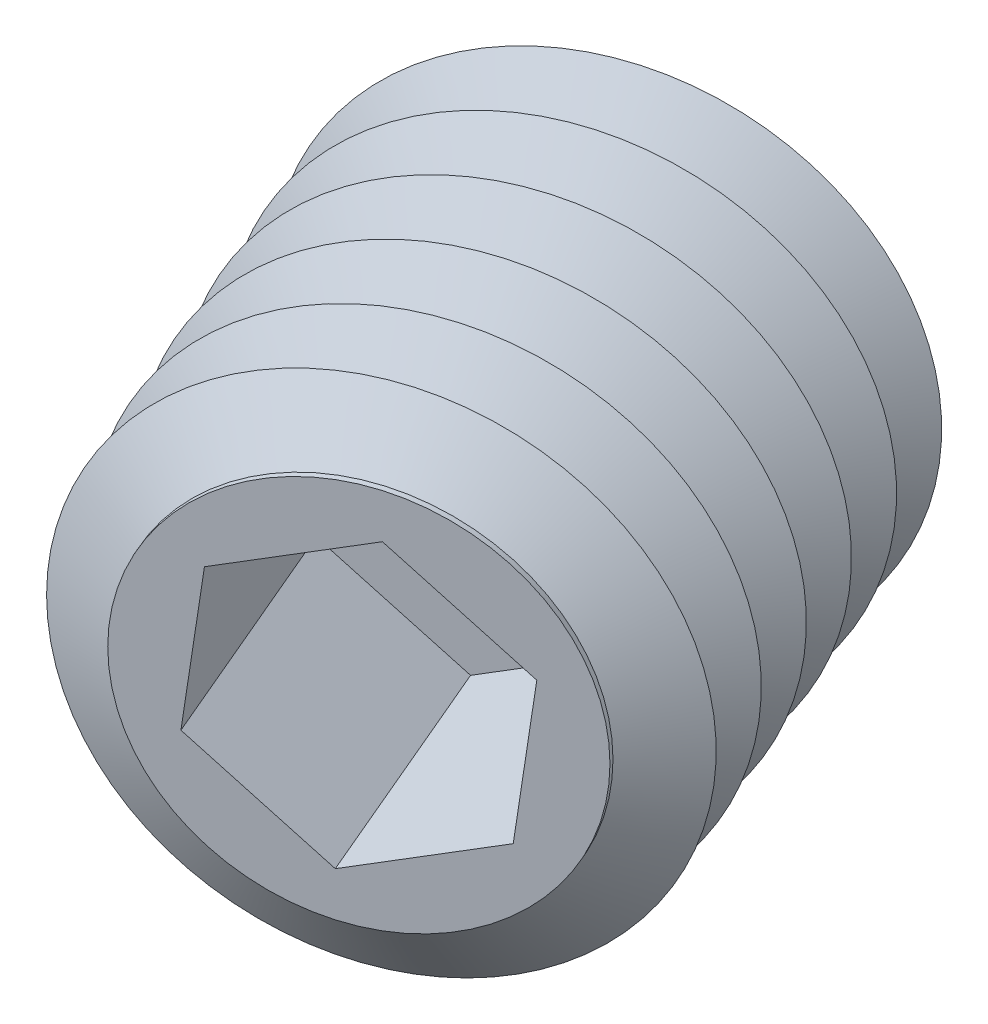
ISO-10303-21;
HEADER;
FILE_DESCRIPTION(('STEP AP214'),'2;1');
FILE_NAME('part.step','',(''),(''),'','','');
FILE_SCHEMA(('AUTOMOTIVE_DESIGN { 1 0 10303 214 1 1 1 1 }'));
ENDSEC;
DATA;
#1=APPLICATION_CONTEXT('core data for automotive mechanical design processes');
#2=APPLICATION_PROTOCOL_DEFINITION('international standard','automotive_design',2000,#1);
#3=PRODUCT_CONTEXT('',#1,'mechanical');
#4=PRODUCT('Part','Part','',(#3));
#5=PRODUCT_RELATED_PRODUCT_CATEGORY('part','',(#4));
#6=PRODUCT_DEFINITION_FORMATION('','',#4);
#7=PRODUCT_DEFINITION_CONTEXT('part definition',#1,'design');
#8=PRODUCT_DEFINITION('design','',#6,#7);
#9=PRODUCT_DEFINITION_SHAPE('','',#8);
#10=(LENGTH_UNIT() NAMED_UNIT(*) SI_UNIT(.MILLI.,.METRE.));
#11=(NAMED_UNIT(*) PLANE_ANGLE_UNIT() SI_UNIT($,.RADIAN.));
#12=(NAMED_UNIT(*) SI_UNIT($,.STERADIAN.) SOLID_ANGLE_UNIT());
#13=UNCERTAINTY_MEASURE_WITH_UNIT(LENGTH_MEASURE(1.E-05),#10,'distance_accuracy_value','');
#14=(GEOMETRIC_REPRESENTATION_CONTEXT(3) GLOBAL_UNCERTAINTY_ASSIGNED_CONTEXT((#13)) GLOBAL_UNIT_ASSIGNED_CONTEXT((#10,
#11,#12)) REPRESENTATION_CONTEXT('',''));
#15=CARTESIAN_POINT('',(0.,0.,0.));
#16=DIRECTION('',(0.,0.,1.));
#17=DIRECTION('',(1.,0.,0.));
#18=AXIS2_PLACEMENT_3D('',#15,#16,#17);
#19=CARTESIAN_POINT('',(53.6140702150309,-7.80000000000007,152.883076301382));
#20=DIRECTION('',(-0.390731128489286,0.,-0.920504853452435));
#21=DIRECTION('',(-0.920504853452435,0.,0.390731128489286));
#22=AXIS2_PLACEMENT_3D('',#19,#20,#21);
#23=CONICAL_SURFACE('',#22,1.99999999996604,0.785398163382625);
#24=CARTESIAN_POINT('',(54.3955324720193,-7.80000000000006,154.72408600831));
#25=VERTEX_POINT('',#24);
#26=VERTEX_LOOP('',#25);
#27=FACE_BOUND('',#26,.T.);
#28=CARTESIAN_POINT('',(53.6140702150309,-7.80000000000007,152.883076301382));
#29=DIRECTION('',(0.390731128489286,0.,0.920504853452435));
#30=DIRECTION('',(0.,-1.,0.));
#31=AXIS2_PLACEMENT_3D('',#28,#29,#30);
#32=CIRCLE('',#31,1.99999999996599);
#33=CARTESIAN_POINT('',(53.6140702150309,-9.79999999996606,152.883076301382));
#34=VERTEX_POINT('',#33);
#35=EDGE_CURVE('E331',#34,#34,#32,.T.);
#36=ORIENTED_EDGE('',*,*,#35,.F.);
#37=EDGE_LOOP('',(#36));
#38=FACE_BOUND('',#37,.T.);
#39=ADVANCED_FACE('F16',(#27,#38),#23,.F.);
#40=CARTESIAN_POINT('',(53.6271572263265,-7.80000000000007,152.913907367904));
#41=DIRECTION('',(0.390731128489274,0.,0.92050485345244));
#42=DIRECTION('',(0.,-1.,0.));
#43=AXIS2_PLACEMENT_3D('',#40,#41,#42);
#44=CYLINDRICAL_SURFACE('',#43,2.25);
#45=CARTESIAN_POINT('',(53.6140702150345,-7.80000000000007,152.883076301391));
#46=DIRECTION('',(-0.390731128489274,0.,-0.92050485345244));
#47=DIRECTION('',(-0.92050485345244,0.,0.390731128489274));
#48=AXIS2_PLACEMENT_3D('',#45,#46,#47);
#49=CIRCLE('',#48,2.25);
#50=CARTESIAN_POINT('',(51.5429342947665,-7.80000000000007,153.762221340491));
#51=VERTEX_POINT('',#50);
#52=EDGE_CURVE('E118',#51,#51,#49,.T.);
#53=ORIENTED_EDGE('',*,*,#52,.F.);
#54=EDGE_LOOP('',(#53));
#55=FACE_BOUND('',#54,.T.);
#56=CARTESIAN_POINT('',(53.6402442376186,-7.80000000000007,152.944738434418));
#57=DIRECTION('',(-0.390731128489274,0.,-0.92050485345244));
#58=DIRECTION('',(-0.92050485345244,0.,0.390731128489274));
#59=AXIS2_PLACEMENT_3D('',#56,#57,#58);
#60=CIRCLE('',#59,2.25);
#61=CARTESIAN_POINT('',(51.5691083173506,-7.80000000000007,153.823883473519));
#62=VERTEX_POINT('',#61);
#63=EDGE_CURVE('E11',#62,#62,#60,.T.);
#64=ORIENTED_EDGE('',*,*,#63,.T.);
#65=EDGE_LOOP('',(#64));
#66=FACE_BOUND('',#65,.T.);
#67=ADVANCED_FACE('F135',(#55,#66),#44,.T.);
#68=CARTESIAN_POINT('',(53.8094357793032,-7.80000000000007,153.343328728173));
#69=DIRECTION('',(0.39073112848927,0.,0.920504853452442));
#70=DIRECTION('',(0.,-1.,0.));
#71=AXIS2_PLACEMENT_3D('',#68,#69,#70);
#72=CONICAL_SURFACE('',#71,3.00000000007299,1.04719755118371);
#73=ORIENTED_EDGE('',*,*,#63,.F.);
#74=EDGE_LOOP('',(#73));
#75=FACE_BOUND('',#74,.T.);
#76=CARTESIAN_POINT('',(53.8094357792894,-7.80000000000007,153.343328728141));
#77=DIRECTION('',(-0.390731128489274,0.,-0.92050485345244));
#78=DIRECTION('',(-0.92050485345244,0.,0.390731128489274));
#79=AXIS2_PLACEMENT_3D('',#76,#77,#78);
#80=CIRCLE('',#79,3.00000000001884);
#81=CARTESIAN_POINT('',(51.0479212189147,-7.80000000000007,154.515522113616));
#82=VERTEX_POINT('',#81);
#83=EDGE_CURVE('E25',#82,#82,#80,.T.);
#84=ORIENTED_EDGE('',*,*,#83,.T.);
#85=EDGE_LOOP('',(#84));
#86=FACE_BOUND('',#85,.T.);
#87=ADVANCED_FACE('F140',(#75,#86),#72,.T.);
#88=CARTESIAN_POINT('',(53.8094357793165,-7.80000000000007,153.343328728205));
#89=DIRECTION('',(-0.390731128489284,0.,-0.920504853452436));
#90=DIRECTION('',(-0.920504853452436,0.,0.390731128489284));
#91=AXIS2_PLACEMENT_3D('',#88,#89,#90);
#92=CONICAL_SURFACE('',#91,2.9999999999349,1.04719755118649);
#93=CARTESIAN_POINT('',(53.9786273209611,-7.80000000000007,153.741919021866));
#94=DIRECTION('',(-0.390731128489274,0.,-0.92050485345244));
#95=DIRECTION('',(-0.92050485345244,0.,0.390731128489274));
#96=AXIS2_PLACEMENT_3D('',#93,#94,#95);
#97=CIRCLE('',#96,2.24999999997654);
#98=CARTESIAN_POINT('',(51.9074914007147,-7.80000000000007,154.621064060957));
#99=VERTEX_POINT('',#98);
#100=EDGE_CURVE('E337',#99,#99,#97,.T.);
#101=ORIENTED_EDGE('',*,*,#100,.T.);
#102=EDGE_LOOP('',(#101));
#103=FACE_BOUND('',#102,.T.);
#104=ORIENTED_EDGE('',*,*,#83,.F.);
#105=EDGE_LOOP('',(#104));
#106=FACE_BOUND('',#105,.T.);
#107=ADVANCED_FACE('F152',(#103,#106),#92,.T.);
#108=CARTESIAN_POINT('',(54.0048013435238,-7.80000000000007,153.803581154843));
#109=DIRECTION('',(0.390731128489274,0.,0.92050485345244));
#110=DIRECTION('',(0.,-1.,0.));
#111=AXIS2_PLACEMENT_3D('',#108,#109,#110);
#112=CYLINDRICAL_SURFACE('',#111,2.25);
#113=ORIENTED_EDGE('',*,*,#100,.F.);
#114=EDGE_LOOP('',(#113));
#115=FACE_BOUND('',#114,.T.);
#116=CARTESIAN_POINT('',(54.0309753661079,-7.80000000000007,153.865243287871));
#117=DIRECTION('',(-0.390731128489274,0.,-0.92050485345244));
#118=DIRECTION('',(-0.92050485345244,0.,0.390731128489274));
#119=AXIS2_PLACEMENT_3D('',#116,#117,#118);
#120=CIRCLE('',#119,2.25);
#121=CARTESIAN_POINT('',(51.9598394458399,-7.80000000000007,154.744388326972));
#122=VERTEX_POINT('',#121);
#123=EDGE_CURVE('E340',#122,#122,#120,.T.);
#124=ORIENTED_EDGE('',*,*,#123,.T.);
#125=EDGE_LOOP('',(#124));
#126=FACE_BOUND('',#125,.T.);
#127=ADVANCED_FACE('F148',(#115,#126),#112,.T.);
#128=CARTESIAN_POINT('',(54.2001669077402,-7.80000000000007,154.263833581503));
#129=DIRECTION('',(0.390731128489276,0.,0.920504853452439));
#130=DIRECTION('',(0.,-1.,0.));
#131=AXIS2_PLACEMENT_3D('',#128,#129,#130);
#132=CONICAL_SURFACE('',#131,2.99999999989111,1.04719755120376);
#133=ORIENTED_EDGE('',*,*,#123,.F.);
#134=EDGE_LOOP('',(#133));
#135=FACE_BOUND('',#134,.T.);
#136=CARTESIAN_POINT('',(54.2001669077627,-7.80000000000007,154.263833581556));
#137=DIRECTION('',(-0.390731128489274,0.,-0.92050485345244));
#138=DIRECTION('',(-0.92050485345244,0.,0.390731128489274));
#139=AXIS2_PLACEMENT_3D('',#136,#137,#138);
#140=CIRCLE('',#139,2.99999999999343);
#141=CARTESIAN_POINT('',(51.4386523474114,-7.80000000000007,155.436026967021));
#142=VERTEX_POINT('',#141);
#143=EDGE_CURVE('E343',#142,#142,#140,.T.);
#144=ORIENTED_EDGE('',*,*,#143,.T.);
#145=EDGE_LOOP('',(#144));
#146=FACE_BOUND('',#145,.T.);
#147=ADVANCED_FACE('F151',(#135,#146),#132,.T.);
#148=CARTESIAN_POINT('',(54.2001669077847,-7.80000000000007,154.263833581608));
#149=DIRECTION('',(-0.390731128489268,0.,-0.920504853452443));
#150=DIRECTION('',(-0.920504853452443,0.,0.390731128489268));
#151=AXIS2_PLACEMENT_3D('',#148,#149,#150);
#152=CONICAL_SURFACE('',#151,2.99999999991459,1.04719755120466);
#153=CARTESIAN_POINT('',(54.3693584494292,-7.80000000000007,154.662423875268));
#154=DIRECTION('',(-0.390731128489274,0.,-0.92050485345244));
#155=DIRECTION('',(-0.92050485345244,0.,0.390731128489274));
#156=AXIS2_PLACEMENT_3D('',#153,#154,#155);
#157=CIRCLE('',#156,2.24999999995626);
#158=CARTESIAN_POINT('',(52.2982225292015,-7.80000000000007,155.541568914352));
#159=VERTEX_POINT('',#158);
#160=EDGE_CURVE('E346',#159,#159,#157,.T.);
#161=ORIENTED_EDGE('',*,*,#160,.T.);
#162=EDGE_LOOP('',(#161));
#163=FACE_BOUND('',#162,.T.);
#164=ORIENTED_EDGE('',*,*,#143,.F.);
#165=EDGE_LOOP('',(#164));
#166=FACE_BOUND('',#165,.T.);
#167=ADVANCED_FACE('F158',(#163,#166),#152,.T.);
#168=CARTESIAN_POINT('',(54.395532472013,-7.80000000000007,154.724086008295));
#169=DIRECTION('',(0.390731128489274,0.,0.92050485345244));
#170=DIRECTION('',(0.,-1.,0.));
#171=AXIS2_PLACEMENT_3D('',#168,#169,#170);
#172=CYLINDRICAL_SURFACE('',#171,2.25);
#173=ORIENTED_EDGE('',*,*,#160,.F.);
#174=EDGE_LOOP('',(#173));
#175=FACE_BOUND('',#174,.T.);
#176=CARTESIAN_POINT('',(54.4217064945971,-7.80000000000007,154.785748141323));
#177=DIRECTION('',(-0.390731128489274,0.,-0.92050485345244));
#178=DIRECTION('',(-0.92050485345244,0.,0.390731128489274));
#179=AXIS2_PLACEMENT_3D('',#176,#177,#178);
#180=CIRCLE('',#179,2.25);
#181=CARTESIAN_POINT('',(52.3505705743291,-7.80000000000007,155.664893180424));
#182=VERTEX_POINT('',#181);
#183=EDGE_CURVE('E349',#182,#182,#180,.T.);
#184=ORIENTED_EDGE('',*,*,#183,.T.);
#185=EDGE_LOOP('',(#184));
#186=FACE_BOUND('',#185,.T.);
#187=ADVANCED_FACE('F154',(#175,#186),#172,.T.);
#188=CARTESIAN_POINT('',(54.59089803626,-7.80000000000007,155.184338435027));
#189=DIRECTION('',(0.390731128489276,0.,0.920504853452439));
#190=DIRECTION('',(0.,-1.,0.));
#191=AXIS2_PLACEMENT_3D('',#188,#189,#190);
#192=CONICAL_SURFACE('',#191,3.000000000012,1.04719755121017);
#193=ORIENTED_EDGE('',*,*,#183,.F.);
#194=EDGE_LOOP('',(#193));
#195=FACE_BOUND('',#194,.T.);
#196=CARTESIAN_POINT('',(54.59089803626,-7.80000000000007,155.184338435027));
#197=DIRECTION('',(-0.390731128489274,0.,-0.92050485345244));
#198=DIRECTION('',(-0.92050485345244,0.,0.390731128489274));
#199=AXIS2_PLACEMENT_3D('',#196,#197,#198);
#200=CIRCLE('',#199,3.00000000001199);
#201=CARTESIAN_POINT('',(51.8293834758916,-7.80000000000007,156.3565318205));
#202=VERTEX_POINT('',#201);
#203=EDGE_CURVE('E352',#202,#202,#200,.T.);
#204=ORIENTED_EDGE('',*,*,#203,.T.);
#205=EDGE_LOOP('',(#204));
#206=FACE_BOUND('',#205,.T.);
#207=ADVANCED_FACE('F157',(#195,#206),#192,.T.);
#208=CARTESIAN_POINT('',(54.5908980362615,-7.80000000000007,155.184338435031));
#209=DIRECTION('',(-0.390731128489273,0.,-0.920504853452441));
#210=DIRECTION('',(-0.920504853452441,0.,0.390731128489273));
#211=AXIS2_PLACEMENT_3D('',#208,#209,#210);
#212=CONICAL_SURFACE('',#211,2.99999999994251,1.04719755118876);
#213=CARTESIAN_POINT('',(54.7600895779265,-7.80000000000007,155.58292872874));
#214=DIRECTION('',(-0.390731128489274,0.,-0.92050485345244));
#215=DIRECTION('',(-0.92050485345244,0.,0.390731128489274));
#216=AXIS2_PLACEMENT_3D('',#213,#214,#215);
#217=CIRCLE('',#216,2.24999999997484);
#218=CARTESIAN_POINT('',(52.6889536576817,-7.80000000000007,156.462073767831));
#219=VERTEX_POINT('',#218);
#220=EDGE_CURVE('E355',#219,#219,#217,.T.);
#221=ORIENTED_EDGE('',*,*,#220,.T.);
#222=EDGE_LOOP('',(#221));
#223=FACE_BOUND('',#222,.T.);
#224=ORIENTED_EDGE('',*,*,#203,.F.);
#225=EDGE_LOOP('',(#224));
#226=FACE_BOUND('',#225,.T.);
#227=ADVANCED_FACE('F164',(#223,#226),#212,.T.);
#228=CARTESIAN_POINT('',(54.7862636005023,-7.80000000000007,155.644590861748));
#229=DIRECTION('',(0.390731128489274,0.,0.92050485345244));
#230=DIRECTION('',(0.,-1.,0.));
#231=AXIS2_PLACEMENT_3D('',#228,#229,#230);
#232=CYLINDRICAL_SURFACE('',#231,2.25);
#233=ORIENTED_EDGE('',*,*,#220,.F.);
#234=EDGE_LOOP('',(#233));
#235=FACE_BOUND('',#234,.T.);
#236=CARTESIAN_POINT('',(54.8124376230864,-7.80000000000007,155.706252994776));
#237=DIRECTION('',(-0.390731128489274,0.,-0.92050485345244));
#238=DIRECTION('',(-0.92050485345244,0.,0.390731128489274));
#239=AXIS2_PLACEMENT_3D('',#236,#237,#238);
#240=CIRCLE('',#239,2.25);
#241=CARTESIAN_POINT('',(52.7413017028184,-7.80000000000007,156.585398033877));
#242=VERTEX_POINT('',#241);
#243=EDGE_CURVE('E358',#242,#242,#240,.T.);
#244=ORIENTED_EDGE('',*,*,#243,.T.);
#245=EDGE_LOOP('',(#244));
#246=FACE_BOUND('',#245,.T.);
#247=ADVANCED_FACE('F160',(#235,#246),#232,.T.);
#248=CARTESIAN_POINT('',(54.9816291647746,-7.80000000000007,156.104843288539));
#249=DIRECTION('',(0.390731128489275,0.,0.92050485345244));
#250=DIRECTION('',(0.,-1.,0.));
#251=AXIS2_PLACEMENT_3D('',#248,#249,#250);
#252=CONICAL_SURFACE('',#251,3.00000000013798,1.04719755119727);
#253=ORIENTED_EDGE('',*,*,#243,.F.);
#254=EDGE_LOOP('',(#253));
#255=FACE_BOUND('',#254,.T.);
#256=CARTESIAN_POINT('',(54.9816291647521,-7.80000000000007,156.104843288486));
#257=DIRECTION('',(-0.390731128489274,0.,-0.92050485345244));
#258=DIRECTION('',(-0.92050485345244,0.,0.390731128489274));
#259=AXIS2_PLACEMENT_3D('',#256,#257,#258);
#260=CIRCLE('',#259,3.00000000002455);
#261=CARTESIAN_POINT('',(52.2201146043722,-7.80000000000007,157.277036673964));
#262=VERTEX_POINT('',#261);
#263=EDGE_CURVE('E361',#262,#262,#260,.T.);
#264=ORIENTED_EDGE('',*,*,#263,.T.);
#265=EDGE_LOOP('',(#264));
#266=FACE_BOUND('',#265,.T.);
#267=ADVANCED_FACE('F163',(#255,#266),#252,.T.);
#268=CARTESIAN_POINT('',(54.9816291647706,-7.80000000000007,156.10484328853));
#269=DIRECTION('',(-0.390731128489278,0.,-0.920504853452439));
#270=DIRECTION('',(-0.920504853452439,0.,0.390731128489278));
#271=AXIS2_PLACEMENT_3D('',#268,#269,#270);
#272=CONICAL_SURFACE('',#271,2.99999999987023,1.04719755119106);
#273=CARTESIAN_POINT('',(55.1508207064034,-7.80000000000007,156.503433582163));
#274=DIRECTION('',(-0.390731128489274,0.,-0.92050485345244));
#275=DIRECTION('',(-0.92050485345244,0.,0.390731128489274));
#276=AXIS2_PLACEMENT_3D('',#273,#274,#275);
#277=CIRCLE('',#276,2.25000000000271);
#278=CARTESIAN_POINT('',(53.0796847861329,-7.80000000000007,157.382578621265));
#279=VERTEX_POINT('',#278);
#280=EDGE_CURVE('E226',#279,#279,#277,.T.);
#281=ORIENTED_EDGE('',*,*,#280,.T.);
#282=EDGE_LOOP('',(#281));
#283=FACE_BOUND('',#282,.T.);
#284=ORIENTED_EDGE('',*,*,#263,.F.);
#285=EDGE_LOOP('',(#284));
#286=FACE_BOUND('',#285,.T.);
#287=ADVANCED_FACE('F179',(#283,#286),#272,.T.);
#288=CARTESIAN_POINT('',(55.1769947289916,-7.80000000000007,156.5650957152));
#289=DIRECTION('',(0.390731128489274,0.,0.92050485345244));
#290=DIRECTION('',(0.,-1.,0.));
#291=AXIS2_PLACEMENT_3D('',#288,#289,#290);
#292=CYLINDRICAL_SURFACE('',#291,2.25);
#293=ORIENTED_EDGE('',*,*,#280,.F.);
#294=EDGE_LOOP('',(#293));
#295=FACE_BOUND('',#294,.T.);
#296=CARTESIAN_POINT('',(55.2031687515757,-7.80000000000007,156.626757848228));
#297=DIRECTION('',(-0.390731128489274,0.,-0.92050485345244));
#298=DIRECTION('',(-0.92050485345244,0.,0.390731128489274));
#299=AXIS2_PLACEMENT_3D('',#296,#297,#298);
#300=CIRCLE('',#299,2.25);
#301=CARTESIAN_POINT('',(53.1320328313077,-7.80000000000007,157.505902887329));
#302=VERTEX_POINT('',#301);
#303=EDGE_CURVE('E219',#302,#302,#300,.T.);
#304=ORIENTED_EDGE('',*,*,#303,.T.);
#305=EDGE_LOOP('',(#304));
#306=FACE_BOUND('',#305,.T.);
#307=ADVANCED_FACE('F175',(#295,#306),#292,.T.);
#308=CARTESIAN_POINT('',(55.3723602932356,-7.80000000000007,157.025348141925));
#309=DIRECTION('',(0.390731128489277,0.,0.920504853452439));
#310=DIRECTION('',(0.,-1.,0.));
#311=AXIS2_PLACEMENT_3D('',#308,#309,#310);
#312=CONICAL_SURFACE('',#311,2.99999999996675,1.04719755117974);
#313=ORIENTED_EDGE('',*,*,#303,.F.);
#314=EDGE_LOOP('',(#313));
#315=FACE_BOUND('',#314,.T.);
#316=CARTESIAN_POINT('',(55.3723602932356,-7.80000000000007,157.025348141925));
#317=DIRECTION('',(-0.390731128489274,0.,-0.92050485345244));
#318=DIRECTION('',(-0.92050485345244,0.,0.390731128489274));
#319=AXIS2_PLACEMENT_3D('',#316,#317,#318);
#320=CIRCLE('',#319,2.99999999996674);
#321=CARTESIAN_POINT('',(52.6108457329089,-7.80000000000007,158.19754152738));
#322=VERTEX_POINT('',#321);
#323=EDGE_CURVE('E222',#322,#322,#320,.T.);
#324=ORIENTED_EDGE('',*,*,#323,.T.);
#325=EDGE_LOOP('',(#324));
#326=FACE_BOUND('',#325,.T.);
#327=ADVANCED_FACE('F178',(#315,#326),#312,.T.);
#328=CARTESIAN_POINT('',(55.3723602932679,-7.80000000000007,157.025348142001));
#329=DIRECTION('',(-0.390731128489272,0.,-0.920504853452441));
#330=DIRECTION('',(-0.920504853452441,0.,0.390731128489272));
#331=AXIS2_PLACEMENT_3D('',#328,#329,#330);
#332=CONICAL_SURFACE('',#331,2.99999999987769,1.04719755123238);
#333=CARTESIAN_POINT('',(55.5415518349007,-7.80000000000007,157.423938435634));
#334=DIRECTION('',(-0.390731128489274,0.,-0.92050485345244));
#335=DIRECTION('',(-0.92050485345244,0.,0.390731128489274));
#336=AXIS2_PLACEMENT_3D('',#333,#334,#335);
#337=CIRCLE('',#336,2.25000000001016);
#338=CARTESIAN_POINT('',(53.4704159146233,-7.80000000000007,158.303083474739));
#339=VERTEX_POINT('',#338);
#340=EDGE_CURVE('E224',#339,#339,#337,.T.);
#341=ORIENTED_EDGE('',*,*,#340,.T.);
#342=EDGE_LOOP('',(#341));
#343=FACE_BOUND('',#342,.T.);
#344=ORIENTED_EDGE('',*,*,#323,.F.);
#345=EDGE_LOOP('',(#344));
#346=FACE_BOUND('',#345,.T.);
#347=ADVANCED_FACE('F184',(#343,#346),#332,.T.);
#348=CARTESIAN_POINT('',(55.5677258574809,-7.80000000000007,157.485600568653));
#349=DIRECTION('',(0.390731128489274,0.,0.92050485345244));
#350=DIRECTION('',(0.,-1.,0.));
#351=AXIS2_PLACEMENT_3D('',#348,#349,#350);
#352=CYLINDRICAL_SURFACE('',#351,2.25);
#353=ORIENTED_EDGE('',*,*,#340,.F.);
#354=EDGE_LOOP('',(#353));
#355=FACE_BOUND('',#354,.T.);
#356=CARTESIAN_POINT('',(55.5938998800649,-7.80000000000007,157.547262701681));
#357=DIRECTION('',(-0.390731128489274,0.,-0.92050485345244));
#358=DIRECTION('',(-0.92050485345244,0.,0.390731128489274));
#359=AXIS2_PLACEMENT_3D('',#356,#357,#358);
#360=CIRCLE('',#359,2.25);
#361=CARTESIAN_POINT('',(53.522763959797,-7.80000000000007,158.426407740781));
#362=VERTEX_POINT('',#361);
#363=EDGE_CURVE('E229',#362,#362,#360,.T.);
#364=ORIENTED_EDGE('',*,*,#363,.T.);
#365=EDGE_LOOP('',(#364));
#366=FACE_BOUND('',#365,.T.);
#367=ADVANCED_FACE('F187',(#355,#366),#352,.T.);
#368=CARTESIAN_POINT('',(55.7630914217641,-7.80000000000007,157.94585299547));
#369=DIRECTION('',(0.390731128489277,0.,0.920504853452439));
#370=DIRECTION('',(0.,-1.,0.));
#371=AXIS2_PLACEMENT_3D('',#368,#369,#370);
#372=CONICAL_SURFACE('',#371,3.00000000014688,1.04719755119729);
#373=ORIENTED_EDGE('',*,*,#363,.F.);
#374=EDGE_LOOP('',(#373));
#375=FACE_BOUND('',#374,.T.);
#376=CARTESIAN_POINT('',(55.7630914217365,-7.80000000000007,157.945852995405));
#377=DIRECTION('',(-0.390731128489274,0.,-0.92050485345244));
#378=DIRECTION('',(-0.92050485345244,0.,0.390731128489274));
#379=AXIS2_PLACEMENT_3D('',#376,#377,#378);
#380=CIRCLE('',#379,3.00000000004966);
#381=CARTESIAN_POINT('',(53.0015768613335,-7.80000000000007,159.118046380892));
#382=VERTEX_POINT('',#381);
#383=EDGE_CURVE('E235',#382,#382,#380,.T.);
#384=ORIENTED_EDGE('',*,*,#383,.T.);
#385=EDGE_LOOP('',(#384));
#386=FACE_BOUND('',#385,.T.);
#387=ADVANCED_FACE('F18',(#375,#386),#372,.T.);
#388=CARTESIAN_POINT('',(55.7630914217447,-7.80000000000007,157.945852995424));
#389=DIRECTION('',(-0.390731128489272,0.,-0.920504853452441));
#390=DIRECTION('',(-0.920504853452441,0.,0.390731128489272));
#391=AXIS2_PLACEMENT_3D('',#388,#389,#390);
#392=CONICAL_SURFACE('',#391,2.9999999999167,1.04719755125472);
#393=CARTESIAN_POINT('',(55.9322829633775,-7.80000000000007,158.344443289057));
#394=DIRECTION('',(-0.390731128489274,0.,-0.92050485345244));
#395=DIRECTION('',(-0.92050485345244,0.,0.390731128489274));
#396=AXIS2_PLACEMENT_3D('',#393,#394,#395);
#397=CIRCLE('',#396,2.25000000004915);
#398=CARTESIAN_POINT('',(53.8611470430643,-7.80000000000007,159.223588328177));
#399=VERTEX_POINT('',#398);
#400=EDGE_CURVE('E238',#399,#399,#397,.T.);
#401=ORIENTED_EDGE('',*,*,#400,.T.);
#402=EDGE_LOOP('',(#401));
#403=FACE_BOUND('',#402,.T.);
#404=ORIENTED_EDGE('',*,*,#383,.F.);
#405=EDGE_LOOP('',(#404));
#406=FACE_BOUND('',#405,.T.);
#407=ADVANCED_FACE('F201',(#403,#406),#392,.T.);
#408=CARTESIAN_POINT('',(55.9453699746781,-7.80000000000007,158.375274355591));
#409=DIRECTION('',(0.390731128489274,0.,0.92050485345244));
#410=DIRECTION('',(0.,-1.,0.));
#411=AXIS2_PLACEMENT_3D('',#408,#409,#410);
#412=CYLINDRICAL_SURFACE('',#411,2.25);
#413=ORIENTED_EDGE('',*,*,#400,.F.);
#414=EDGE_LOOP('',(#413));
#415=FACE_BOUND('',#414,.T.);
#416=CARTESIAN_POINT('',(55.9584569859701,-7.80000000000007,158.406105422105));
#417=DIRECTION('',(-0.390731128489274,0.,-0.92050485345244));
#418=DIRECTION('',(-0.92050485345244,0.,0.390731128489274));
#419=AXIS2_PLACEMENT_3D('',#416,#417,#418);
#420=CIRCLE('',#419,2.25);
#421=CARTESIAN_POINT('',(53.8873210657021,-7.80000000000007,159.285250461206));
#422=VERTEX_POINT('',#421);
#423=EDGE_CURVE('E241',#422,#422,#420,.T.);
#424=ORIENTED_EDGE('',*,*,#423,.T.);
#425=EDGE_LOOP('',(#424));
#426=FACE_BOUND('',#425,.T.);
#427=ADVANCED_FACE('F204',(#415,#426),#412,.T.);
#428=CARTESIAN_POINT('',(53.3186464009489,-8.47676616664219,156.267557402794));
#429=DIRECTION('',(-0.913643549861379,0.121869343405148,0.387818677908499));
#430=DIRECTION('',(0.390731128489274,0.,0.92050485345244));
#431=AXIS2_PLACEMENT_3D('',#428,#429,#430);
#432=PLANE('',#431);
#433=DIRECTION('',(-0.390731128489275,0.,-0.92050485345244));
#434=VECTOR('',#433,1.);
#435=CARTESIAN_POINT('',(54.4908397864167,-8.47676616664218,159.029071963152));
#436=LINE('',#435,#434);
#437=CARTESIAN_POINT('',(54.4908397864167,-8.47676616664219,159.029071963152));
#438=VERTEX_POINT('',#437);
#439=CARTESIAN_POINT('',(53.3186464009489,-8.47676616664219,156.267557402794));
#440=VERTEX_POINT('',#439);
#441=EDGE_CURVE('E244',#438,#440,#436,.T.);
#442=ORIENTED_EDGE('',*,*,#441,.T.);
#443=DIRECTION('',(-0.112181322091501,-0.992546151641322,0.0476181460769404));
#444=VECTOR('',#443,1.);
#445=CARTESIAN_POINT('',(53.3186464009489,-8.47676616664219,156.267557402794));
#446=LINE('',#445,#444);
#447=CARTESIAN_POINT('',(53.5129501504716,-6.75762580314247,156.185080354427));
#448=VERTEX_POINT('',#447);
#449=EDGE_CURVE('E37',#448,#440,#446,.T.);
#450=ORIENTED_EDGE('',*,*,#449,.F.);
#451=DIRECTION('',(0.390731128489273,0.,0.920504853452441));
#452=VECTOR('',#451,1.);
#453=CARTESIAN_POINT('',(53.5129501504716,-6.75762580314248,156.185080354427));
#454=LINE('',#453,#452);
#455=CARTESIAN_POINT('',(54.6851435359394,-6.75762580314247,158.946594914784));
#456=VERTEX_POINT('',#455);
#457=EDGE_CURVE('E245',#448,#456,#454,.T.);
#458=ORIENTED_EDGE('',*,*,#457,.T.);
#459=DIRECTION('',(0.112181322091501,0.992546151641322,-0.0476181460769404));
#460=VECTOR('',#459,1.);
#461=CARTESIAN_POINT('',(54.4908397864167,-8.47676616664219,159.029071963152));
#462=LINE('',#461,#460);
#463=EDGE_CURVE('E97',#438,#456,#462,.T.);
#464=ORIENTED_EDGE('',*,*,#463,.F.);
#465=EDGE_LOOP('',(#442,#450,#458,#464));
#466=FACE_BOUND('',#465,.T.);
#467=ADVANCED_FACE('F208',(#466),#432,.F.);
#468=CARTESIAN_POINT('',(54.5919598509796,-9.51914036349979,155.727067910115));
#469=DIRECTION('',(-0.553973649692054,-0.798635510047292,0.235147863137999));
#470=DIRECTION('',(0.821675615177147,-0.569955422312356,0.));
#471=AXIS2_PLACEMENT_3D('',#468,#469,#470);
#472=PLANE('',#471);
#473=DIRECTION('',(-0.390731128489271,0.,-0.920504853452441));
#474=VECTOR('',#473,1.);
#475=CARTESIAN_POINT('',(55.7641532364474,-9.5191403634998,158.488582470473));
#476=LINE('',#475,#474);
#477=CARTESIAN_POINT('',(55.7641532364474,-9.51914036349979,158.488582470473));
#478=VERTEX_POINT('',#477);
#479=CARTESIAN_POINT('',(54.5919598509796,-9.51914036349979,155.727067910115));
#480=VERTEX_POINT('',#479);
#481=EDGE_CURVE('E110',#478,#480,#476,.T.);
#482=ORIENTED_EDGE('',*,*,#481,.T.);
#483=DIRECTION('',(0.735147863137989,-0.601815023152049,-0.312051754092405));
#484=VECTOR('',#483,1.);
#485=CARTESIAN_POINT('',(53.3186464009489,-8.47676616664218,156.267557402794));
#486=LINE('',#485,#484);
#487=EDGE_CURVE('E104',#440,#480,#486,.T.);
#488=ORIENTED_EDGE('',*,*,#487,.F.);
#489=ORIENTED_EDGE('',*,*,#441,.F.);
#490=DIRECTION('',(-0.735147863137995,0.60181502315205,0.312051754092391));
#491=VECTOR('',#490,1.);
#492=CARTESIAN_POINT('',(55.7641532364474,-9.51914036349978,158.488582470473));
#493=LINE('',#492,#491);
#494=EDGE_CURVE('E94',#478,#438,#493,.T.);
#495=ORIENTED_EDGE('',*,*,#494,.F.);
#496=EDGE_LOOP('',(#482,#488,#489,#495));
#497=FACE_BOUND('',#496,.T.);
#498=ADVANCED_FACE('F254',(#497),#472,.F.);
#499=CARTESIAN_POINT('',(53.5129501504716,-6.75762580314248,156.185080354427));
#500=DIRECTION('',(-0.359669900169325,0.920504853452441,0.152670814770501));
#501=DIRECTION('',(-0.931423843949237,-0.363936289648102,0.));
#502=AXIS2_PLACEMENT_3D('',#499,#500,#501);
#503=PLANE('',#502);
#504=ORIENTED_EDGE('',*,*,#457,.F.);
#505=DIRECTION('',(0.847329185229502,0.390731128489259,-0.359669900169334));
#506=VECTOR('',#505,1.);
#507=CARTESIAN_POINT('',(53.5129501504716,-6.75762580314248,156.185080354427));
#508=LINE('',#507,#506);
#509=CARTESIAN_POINT('',(54.980567350025,-6.08085963650035,155.56211381338));
#510=VERTEX_POINT('',#509);
#511=EDGE_CURVE('E113',#448,#510,#508,.T.);
#512=ORIENTED_EDGE('',*,*,#511,.T.);
#513=DIRECTION('',(0.390731128489275,0.,0.92050485345244));
#514=VECTOR('',#513,1.);
#515=CARTESIAN_POINT('',(54.980567350025,-6.08085963650035,155.56211381338));
#516=LINE('',#515,#514);
#517=CARTESIAN_POINT('',(56.1527607354928,-6.08085963650034,158.323628373738));
#518=VERTEX_POINT('',#517);
#519=EDGE_CURVE('E116',#510,#518,#516,.T.);
#520=ORIENTED_EDGE('',*,*,#519,.T.);
#521=DIRECTION('',(0.847329185229496,0.390731128489272,-0.359669900169334));
#522=VECTOR('',#521,1.);
#523=CARTESIAN_POINT('',(54.6851435359394,-6.75762580314247,158.946594914784));
#524=LINE('',#523,#522);
#525=EDGE_CURVE('E76',#456,#518,#524,.T.);
#526=ORIENTED_EDGE('',*,*,#525,.F.);
#527=EDGE_LOOP('',(#504,#512,#520,#526));
#528=FACE_BOUND('',#527,.T.);
#529=ADVANCED_FACE('F132',(#528),#503,.F.);
#530=CARTESIAN_POINT('',(56.059577050533,-8.84237419685766,155.104101369069));
#531=DIRECTION('',(0.359669900169325,-0.920504853452441,-0.152670814770501));
#532=DIRECTION('',(0.931423843949237,0.363936289648102,0.));
#533=AXIS2_PLACEMENT_3D('',#530,#531,#532);
#534=PLANE('',#533);
#535=DIRECTION('',(-0.390731128489274,0.,-0.92050485345244));
#536=VECTOR('',#535,1.);
#537=CARTESIAN_POINT('',(56.059577050533,-8.84237419685766,155.104101369069));
#538=LINE('',#537,#536);
#539=CARTESIAN_POINT('',(57.2317704360008,-8.84237419685766,157.865615929426));
#540=VERTEX_POINT('',#539);
#541=CARTESIAN_POINT('',(56.059577050533,-8.84237419685766,155.104101369069));
#542=VERTEX_POINT('',#541);
#543=EDGE_CURVE('E92',#540,#542,#538,.T.);
#544=ORIENTED_EDGE('',*,*,#543,.T.);
#545=DIRECTION('',(-0.8473291852295,-0.390731128489262,0.359669900169336));
#546=VECTOR('',#545,1.);
#547=CARTESIAN_POINT('',(56.059577050533,-8.84237419685766,155.104101369069));
#548=LINE('',#547,#546);
#549=EDGE_CURVE('E101',#542,#480,#548,.T.);
#550=ORIENTED_EDGE('',*,*,#549,.T.);
#551=ORIENTED_EDGE('',*,*,#481,.F.);
#552=DIRECTION('',(-0.847329185229501,-0.390731128489273,0.35966990016932));
#553=VECTOR('',#552,1.);
#554=CARTESIAN_POINT('',(57.2317704360008,-8.84237419685766,157.865615929426));
#555=LINE('',#554,#553);
#556=EDGE_CURVE('E93',#540,#478,#555,.T.);
#557=ORIENTED_EDGE('',*,*,#556,.F.);
#558=EDGE_LOOP('',(#544,#550,#551,#557));
#559=FACE_BOUND('',#558,.T.);
#560=ADVANCED_FACE('F122',(#559),#534,.F.);
#561=CARTESIAN_POINT('',(54.7862636005023,-7.80000000000007,155.644590861748));
#562=DIRECTION('',(-0.390731128489274,0.,-0.92050485345244));
#563=DIRECTION('',(-0.92050485345244,0.,0.390731128489274));
#564=AXIS2_PLACEMENT_3D('',#561,#562,#563);
#565=PLANE('',#564);
#566=DIRECTION('',(-0.735147863138004,0.601815023152048,0.312051754092374));
#567=VECTOR('',#566,1.);
#568=CARTESIAN_POINT('',(56.2538808000558,-7.12323383335795,155.021624320701));
#569=LINE('',#568,#567);
#570=CARTESIAN_POINT('',(56.2538808000557,-7.12323383335797,155.021624320701));
#571=VERTEX_POINT('',#570);
#572=EDGE_CURVE('E84',#571,#510,#569,.T.);
#573=ORIENTED_EDGE('',*,*,#572,.T.);
#574=ORIENTED_EDGE('',*,*,#511,.F.);
#575=ORIENTED_EDGE('',*,*,#449,.T.);
#576=ORIENTED_EDGE('',*,*,#487,.T.);
#577=ORIENTED_EDGE('',*,*,#549,.F.);
#578=DIRECTION('',(0.1121813220915,0.992546151641322,-0.0476181460769401));
#579=VECTOR('',#578,1.);
#580=CARTESIAN_POINT('',(56.2538808000557,-7.12323383335797,155.021624320701));
#581=LINE('',#580,#579);
#582=EDGE_CURVE('E87',#542,#571,#581,.T.);
#583=ORIENTED_EDGE('',*,*,#582,.T.);
#584=EDGE_LOOP('',(#573,#574,#575,#576,#577,#583));
#585=FACE_BOUND('',#584,.T.);
#586=ADVANCED_FACE('F123',(#585),#565,.F.);
#587=CARTESIAN_POINT('',(54.980567350025,-6.08085963650035,155.56211381338));
#588=DIRECTION('',(0.553973649692054,0.798635510047293,-0.235147863137998));
#589=DIRECTION('',(-0.821675615177148,0.569955422312355,0.));
#590=AXIS2_PLACEMENT_3D('',#587,#588,#589);
#591=PLANE('',#590);
#592=ORIENTED_EDGE('',*,*,#519,.F.);
#593=ORIENTED_EDGE('',*,*,#572,.F.);
#594=DIRECTION('',(0.390731128489274,0.,0.92050485345244));
#595=VECTOR('',#594,1.);
#596=CARTESIAN_POINT('',(56.2538808000557,-7.12323383335797,155.021624320701));
#597=LINE('',#596,#595);
#598=CARTESIAN_POINT('',(57.4260741855236,-7.12323383335796,157.783138881059));
#599=VERTEX_POINT('',#598);
#600=EDGE_CURVE('E79',#571,#599,#597,.T.);
#601=ORIENTED_EDGE('',*,*,#600,.T.);
#602=DIRECTION('',(0.735147863138002,-0.601815023152049,-0.312051754092375));
#603=VECTOR('',#602,1.);
#604=CARTESIAN_POINT('',(56.1527607354929,-6.08085963650035,158.323628373738));
#605=LINE('',#604,#603);
#606=EDGE_CURVE('E70',#518,#599,#605,.T.);
#607=ORIENTED_EDGE('',*,*,#606,.F.);
#608=EDGE_LOOP('',(#592,#593,#601,#607));
#609=FACE_BOUND('',#608,.T.);
#610=ADVANCED_FACE('F82',(#609),#591,.F.);
#611=CARTESIAN_POINT('',(56.2538808000557,-7.12323383335797,155.021624320701));
#612=DIRECTION('',(0.913643549861379,-0.121869343405148,-0.387818677908499));
#613=DIRECTION('',(-0.390731128489274,0.,-0.92050485345244));
#614=AXIS2_PLACEMENT_3D('',#611,#612,#613);
#615=PLANE('',#614);
#616=ORIENTED_EDGE('',*,*,#600,.F.);
#617=ORIENTED_EDGE('',*,*,#582,.F.);
#618=ORIENTED_EDGE('',*,*,#543,.F.);
#619=DIRECTION('',(-0.112181322091508,-0.992546151641321,0.0476181460769442));
#620=VECTOR('',#619,1.);
#621=CARTESIAN_POINT('',(57.4260741855236,-7.12323383335797,157.783138881059));
#622=LINE('',#621,#620);
#623=EDGE_CURVE('E20',#599,#540,#622,.T.);
#624=ORIENTED_EDGE('',*,*,#623,.F.);
#625=EDGE_LOOP('',(#616,#617,#618,#624));
#626=FACE_BOUND('',#625,.T.);
#627=ADVANCED_FACE('F90',(#626),#615,.F.);
#628=CARTESIAN_POINT('',(56.9117023193533,-7.36042748044963,158.001476784415));
#629=DIRECTION('',(0.390731128489274,0.,0.92050485345244));
#630=DIRECTION('',(0.92050485345244,0.,-0.390731128489274));
#631=AXIS2_PLACEMENT_3D('',#628,#629,#630);
#632=PLANE('',#631);
#633=ORIENTED_EDGE('',*,*,#423,.F.);
#634=EDGE_LOOP('',(#633));
#635=FACE_BOUND('',#634,.T.);
#636=ORIENTED_EDGE('',*,*,#606,.T.);
#637=ORIENTED_EDGE('',*,*,#623,.T.);
#638=ORIENTED_EDGE('',*,*,#556,.T.);
#639=ORIENTED_EDGE('',*,*,#494,.T.);
#640=ORIENTED_EDGE('',*,*,#463,.T.);
#641=ORIENTED_EDGE('',*,*,#525,.T.);
#642=EDGE_LOOP('',(#636,#637,#638,#639,#640,#641));
#643=FACE_BOUND('',#642,.T.);
#644=ADVANCED_FACE('F72',(#635,#643),#632,.T.);
#645=CARTESIAN_POINT('',(54.5673155484177,-7.36042748044963,152.4784476637));
#646=DIRECTION('',(-0.390731128489274,0.,-0.92050485345244));
#647=DIRECTION('',(-0.92050485345244,0.,0.390731128489274));
#648=AXIS2_PLACEMENT_3D('',#645,#646,#647);
#649=PLANE('',#648);
#650=ORIENTED_EDGE('',*,*,#52,.T.);
#651=EDGE_LOOP('',(#650));
#652=FACE_BOUND('',#651,.T.);
#653=ORIENTED_EDGE('',*,*,#35,.T.);
#654=EDGE_LOOP('',(#653));
#655=FACE_BOUND('',#654,.T.);
#656=ADVANCED_FACE('F145',(#652,#655),#649,.T.);
#657=CLOSED_SHELL('',(#39,#67,#87,#107,#127,#147,#167,#187,#207,#227,#247,#267,#287,#307,#327,
#347,#367,#387,#407,#427,#467,#498,#529,#560,#586,#610,#627,#644,#656));
#658=MANIFOLD_SOLID_BREP('B1',#657);
#659=ADVANCED_BREP_SHAPE_REPRESENTATION('',(#18,#658),#14);
#660=SHAPE_DEFINITION_REPRESENTATION(#9,#659);
ENDSEC;
END-ISO-10303-21;
